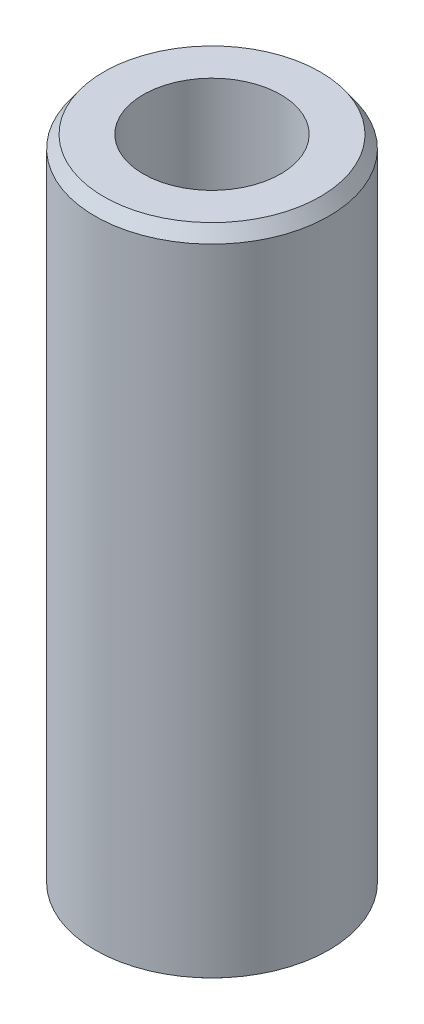
ISO-10303-21;
HEADER;
FILE_DESCRIPTION(('STEP AP214'),'2;1');
FILE_NAME('part.step','',(''),(''),'','','');
FILE_SCHEMA(('AUTOMOTIVE_DESIGN { 1 0 10303 214 1 1 1 1 }'));
ENDSEC;
DATA;
#1=APPLICATION_CONTEXT('core data for automotive mechanical design processes');
#2=APPLICATION_PROTOCOL_DEFINITION('international standard','automotive_design',2000,#1);
#3=PRODUCT_CONTEXT('',#1,'mechanical');
#4=PRODUCT('Part','Part','',(#3));
#5=PRODUCT_RELATED_PRODUCT_CATEGORY('part','',(#4));
#6=PRODUCT_DEFINITION_FORMATION('','',#4);
#7=PRODUCT_DEFINITION_CONTEXT('part definition',#1,'design');
#8=PRODUCT_DEFINITION('design','',#6,#7);
#9=PRODUCT_DEFINITION_SHAPE('','',#8);
#10=(LENGTH_UNIT() NAMED_UNIT(*) SI_UNIT(.MILLI.,.METRE.));
#11=(NAMED_UNIT(*) PLANE_ANGLE_UNIT() SI_UNIT($,.RADIAN.));
#12=(NAMED_UNIT(*) SI_UNIT($,.STERADIAN.) SOLID_ANGLE_UNIT());
#13=UNCERTAINTY_MEASURE_WITH_UNIT(LENGTH_MEASURE(1.E-05),#10,'distance_accuracy_value','');
#14=(GEOMETRIC_REPRESENTATION_CONTEXT(3) GLOBAL_UNCERTAINTY_ASSIGNED_CONTEXT((#13)) GLOBAL_UNIT_ASSIGNED_CONTEXT((#10,
#11,#12)) REPRESENTATION_CONTEXT('',''));
#15=CARTESIAN_POINT('',(0.,0.,0.));
#16=DIRECTION('',(0.,0.,1.));
#17=DIRECTION('',(1.,0.,0.));
#18=AXIS2_PLACEMENT_3D('',#15,#16,#17);
#19=CARTESIAN_POINT('',(0.,98.253043161147,0.));
#20=DIRECTION('',(0.,-1.,0.));
#21=DIRECTION('',(0.,0.,-1.));
#22=AXIS2_PLACEMENT_3D('',#19,#20,#21);
#23=CYLINDRICAL_SURFACE('',#22,17.5);
#24=CARTESIAN_POINT('',(0.,96.3891057133888,0.));
#25=DIRECTION('',(0.,1.,0.));
#26=DIRECTION('',(0.,0.,1.));
#27=AXIS2_PLACEMENT_3D('',#24,#25,#26);
#28=CIRCLE('',#27,17.5);
#29=CARTESIAN_POINT('',(0.,96.3891057133888,-17.5));
#30=VERTEX_POINT('',#29);
#31=EDGE_CURVE('E50',#30,#30,#28,.F.);
#32=ORIENTED_EDGE('',*,*,#31,.T.);
#33=EDGE_LOOP('',(#32));
#34=FACE_BOUND('',#33,.T.);
#35=CARTESIAN_POINT('',(0.,1.31401541733753,0.));
#36=DIRECTION('',(0.,1.,0.));
#37=DIRECTION('',(0.,0.,1.));
#38=AXIS2_PLACEMENT_3D('',#35,#36,#37);
#39=CIRCLE('',#38,17.5);
#40=CARTESIAN_POINT('',(0.,1.31401541733753,17.5));
#41=VERTEX_POINT('',#40);
#42=EDGE_CURVE('E51',#41,#41,#39,.T.);
#43=ORIENTED_EDGE('',*,*,#42,.T.);
#44=EDGE_LOOP('',(#43));
#45=FACE_BOUND('',#44,.T.);
#46=ADVANCED_FACE('F39',(#34,#45),#23,.T.);
#47=CARTESIAN_POINT('',(0.,98.253043161147,0.));
#48=DIRECTION('',(0.,1.,0.));
#49=DIRECTION('',(0.,0.,1.));
#50=AXIS2_PLACEMENT_3D('',#47,#48,#49);
#51=PLANE('',#50);
#52=CARTESIAN_POINT('',(0.,98.253043161147,0.));
#53=DIRECTION('',(0.,1.,0.));
#54=DIRECTION('',(0.,0.,1.));
#55=AXIS2_PLACEMENT_3D('',#52,#53,#54);
#56=CIRCLE('',#55,16.1859845826625);
#57=CARTESIAN_POINT('',(0.,98.253043161147,-16.1859845826625));
#58=VERTEX_POINT('',#57);
#59=EDGE_CURVE('E54',#58,#58,#56,.T.);
#60=ORIENTED_EDGE('',*,*,#59,.T.);
#61=EDGE_LOOP('',(#60));
#62=FACE_BOUND('',#61,.T.);
#63=CARTESIAN_POINT('',(0.,98.253043161147,0.));
#64=DIRECTION('',(0.,1.,0.));
#65=DIRECTION('',(0.,0.,1.));
#66=AXIS2_PLACEMENT_3D('',#63,#64,#65);
#67=CIRCLE('',#66,10.2834657674829);
#68=CARTESIAN_POINT('',(0.,98.253043161147,10.2834657674829));
#69=VERTEX_POINT('',#68);
#70=EDGE_CURVE('E58',#69,#69,#67,.T.);
#71=ORIENTED_EDGE('',*,*,#70,.F.);
#72=EDGE_LOOP('',(#71));
#73=FACE_BOUND('',#72,.T.);
#74=ADVANCED_FACE('F69',(#62,#73),#51,.T.);
#75=CARTESIAN_POINT('',(0.,0.,0.));
#76=DIRECTION('',(0.,1.,0.));
#77=DIRECTION('',(0.,0.,1.));
#78=AXIS2_PLACEMENT_3D('',#75,#76,#77);
#79=PLANE('',#78);
#80=CARTESIAN_POINT('',(0.,0.,0.));
#81=DIRECTION('',(0.,1.,0.));
#82=DIRECTION('',(0.,0.,1.));
#83=AXIS2_PLACEMENT_3D('',#80,#81,#82);
#84=CIRCLE('',#83,15.6360625522419);
#85=CARTESIAN_POINT('',(0.,0.,15.6360625522419));
#86=VERTEX_POINT('',#85);
#87=EDGE_CURVE('E10',#86,#86,#84,.F.);
#88=ORIENTED_EDGE('',*,*,#87,.T.);
#89=EDGE_LOOP('',(#88));
#90=FACE_BOUND('',#89,.T.);
#91=CARTESIAN_POINT('',(0.,0.,0.));
#92=DIRECTION('',(0.,1.,0.));
#93=DIRECTION('',(0.,0.,1.));
#94=AXIS2_PLACEMENT_3D('',#91,#92,#93);
#95=CIRCLE('',#94,10.2834657674829);
#96=CARTESIAN_POINT('',(0.,0.,10.2834657674829));
#97=VERTEX_POINT('',#96);
#98=EDGE_CURVE('E63',#97,#97,#95,.T.);
#99=ORIENTED_EDGE('',*,*,#98,.T.);
#100=EDGE_LOOP('',(#99));
#101=FACE_BOUND('',#100,.T.);
#102=ADVANCED_FACE('F75',(#90,#101),#79,.F.);
#103=CARTESIAN_POINT('',(0.,98.253043161147,0.));
#104=DIRECTION('',(0.,-1.,0.));
#105=DIRECTION('',(0.,0.,-1.));
#106=AXIS2_PLACEMENT_3D('',#103,#104,#105);
#107=CYLINDRICAL_SURFACE('',#106,10.2834657674829);
#108=ORIENTED_EDGE('',*,*,#70,.T.);
#109=EDGE_LOOP('',(#108));
#110=FACE_BOUND('',#109,.T.);
#111=ORIENTED_EDGE('',*,*,#98,.F.);
#112=EDGE_LOOP('',(#111));
#113=FACE_BOUND('',#112,.T.);
#114=ADVANCED_FACE('F70',(#110,#113),#107,.F.);
#115=CARTESIAN_POINT('',(0.,98.253043161147,0.));
#116=DIRECTION('',(0.,-1.,0.));
#117=DIRECTION('',(0.,0.,-1.));
#118=AXIS2_PLACEMENT_3D('',#115,#116,#117);
#119=CONICAL_SURFACE('',#118,16.1859845826625,0.614052116383976);
#120=CARTESIAN_POINT('',(0.,96.3891057133888,-17.5));
#121=CARTESIAN_POINT('',(0.,96.4085217284696,-17.4863123394027));
#122=CARTESIAN_POINT('',(0.,96.4279377435504,-17.4726246788055));
#123=CARTESIAN_POINT('',(0.,96.4667697737121,-17.4452493576109));
#124=CARTESIAN_POINT('',(0.,96.4861857887929,-17.4315616970137));
#125=CARTESIAN_POINT('',(0.,96.5250178189545,-17.4041863758191));
#126=CARTESIAN_POINT('',(0.,96.5444338340353,-17.3904987152219));
#127=CARTESIAN_POINT('',(0.,96.583265864197,-17.3631233940274));
#128=CARTESIAN_POINT('',(0.,96.6026818792778,-17.3494357334301));
#129=CARTESIAN_POINT('',(0.,96.6415139094394,-17.3220604122356));
#130=CARTESIAN_POINT('',(0.,96.6609299245202,-17.3083727516383));
#131=CARTESIAN_POINT('',(0.,96.6997619546818,-17.2809974304438));
#132=CARTESIAN_POINT('',(0.,96.7191779697627,-17.2673097698465));
#133=CARTESIAN_POINT('',(0.,96.7580099999243,-17.239934448652));
#134=CARTESIAN_POINT('',(0.,96.7774260150051,-17.2262467880547));
#135=CARTESIAN_POINT('',(0.,96.8162580451667,-17.1988714668602));
#136=CARTESIAN_POINT('',(0.,96.8356740602475,-17.1851838062629));
#137=CARTESIAN_POINT('',(0.,96.8745060904092,-17.1578084850684));
#138=CARTESIAN_POINT('',(0.,96.89392210549,-17.1441208244711));
#139=CARTESIAN_POINT('',(0.,96.9327541356516,-17.1167455032766));
#140=CARTESIAN_POINT('',(0.,96.9521701507324,-17.1030578426793));
#141=CARTESIAN_POINT('',(0.,96.9910021808941,-17.0756825214848));
#142=CARTESIAN_POINT('',(0.,97.0104181959749,-17.0619948608875));
#143=CARTESIAN_POINT('',(0.,97.0492502261365,-17.034619539693));
#144=CARTESIAN_POINT('',(0.,97.0686662412173,-17.0209318790957));
#145=CARTESIAN_POINT('',(0.,97.1074982713789,-16.9935565579012));
#146=CARTESIAN_POINT('',(0.,97.1269142864598,-16.9798688973039));
#147=CARTESIAN_POINT('',(0.,97.1657463166214,-16.9524935761094));
#148=CARTESIAN_POINT('',(0.,97.1851623317022,-16.9388059155121));
#149=CARTESIAN_POINT('',(0.,97.2239943618638,-16.9114305943176));
#150=CARTESIAN_POINT('',(0.,97.2434103769446,-16.8977429337203));
#151=CARTESIAN_POINT('',(0.,97.2822424071063,-16.8703676125258));
#152=CARTESIAN_POINT('',(0.,97.3016584221871,-16.8566799519285));
#153=CARTESIAN_POINT('',(0.,97.3404904523487,-16.829304630734));
#154=CARTESIAN_POINT('',(0.,97.3599064674295,-16.8156169701367));
#155=CARTESIAN_POINT('',(0.,97.3987384975912,-16.7882416489422));
#156=CARTESIAN_POINT('',(0.,97.418154512672,-16.7745539883449));
#157=CARTESIAN_POINT('',(0.,97.4569865428336,-16.7471786671504));
#158=CARTESIAN_POINT('',(0.,97.4764025579144,-16.7334910065531));
#159=CARTESIAN_POINT('',(0.,97.5152345880761,-16.7061156853586));
#160=CARTESIAN_POINT('',(0.,97.5346506031569,-16.6924280247613));
#161=CARTESIAN_POINT('',(0.,97.5734826333185,-16.6650527035668));
#162=CARTESIAN_POINT('',(0.,97.5928986483993,-16.6513650429695));
#163=CARTESIAN_POINT('',(0.,97.6317306785609,-16.623989721775));
#164=CARTESIAN_POINT('',(0.,97.6511466936417,-16.6103020611777));
#165=CARTESIAN_POINT('',(0.,97.6899787238034,-16.5829267399832));
#166=CARTESIAN_POINT('',(0.,97.7093947388842,-16.5692390793859));
#167=CARTESIAN_POINT('',(0.,97.7482267690458,-16.5418637581914));
#168=CARTESIAN_POINT('',(0.,97.7676427841266,-16.5281760975941));
#169=CARTESIAN_POINT('',(0.,97.8064748142883,-16.5008007763996));
#170=CARTESIAN_POINT('',(0.,97.8258908293691,-16.4871131158023));
#171=CARTESIAN_POINT('',(0.,97.8647228595307,-16.4597377946078));
#172=CARTESIAN_POINT('',(0.,97.8841388746115,-16.4460501340105));
#173=CARTESIAN_POINT('',(0.,97.9229709047731,-16.418674812816));
#174=CARTESIAN_POINT('',(0.,97.942386919854,-16.4049871522187));
#175=CARTESIAN_POINT('',(0.,97.9812189500156,-16.3776118310242));
#176=CARTESIAN_POINT('',(0.,98.0006349650964,-16.3639241704269));
#177=CARTESIAN_POINT('',(0.,98.039466995258,-16.3365488492324));
#178=CARTESIAN_POINT('',(0.,98.0588830103388,-16.3228611886351));
#179=CARTESIAN_POINT('',(0.,98.0977150405005,-16.2954858674406));
#180=CARTESIAN_POINT('',(0.,98.1171310555813,-16.2817982068433));
#181=CARTESIAN_POINT('',(0.,98.1559630857429,-16.2544228856488));
#182=CARTESIAN_POINT('',(0.,98.1753791008237,-16.2407352250515));
#183=CARTESIAN_POINT('',(0.,98.2142111309854,-16.213359903857));
#184=CARTESIAN_POINT('',(0.,98.2336271460662,-16.1996722432597));
#185=CARTESIAN_POINT('',(0.,98.253043161147,-16.1859845826625));
#186=B_SPLINE_CURVE_WITH_KNOTS('',3,(#120,#121,#122,#123,#124,#125,#126,#127,#128,#129,#130,
#131,#132,#133,#134,#135,#136,#137,#138,#139,#140,#141,#142,#143,#144,#145,#146,#147,#148,#149,
#150,#151,#152,#153,#154,#155,#156,#157,#158,#159,#160,#161,#162,#163,#164,#165,#166,#167,#168,
#169,#170,#171,#172,#173,#174,#175,#176,#177,#178,#179,#180,#181,#182,#183,#184,#185),
.UNSPECIFIED.,.F.,.F.,(4,2,2,2,2,2,2,2,2,2,2,2,2,2,2,2,2,2,2,2,2,2,2,2,2,2,2,2,2,2,2,2,4),(0.,
0.0712671259992962,0.142534251998592,0.213801377997889,0.285068503997185,0.356335629996481,
0.427602755995766,0.498869881995062,0.570137007994359,0.641404133993655,0.712671259992951,
0.783938385992234,0.85520551199153,0.926472637990827,0.997739763990123,1.06900688998942,
1.1402740159887,1.211541141988,1.2828082679873,1.35407539398659,1.42534251998589,
1.49660964598518,1.56787677198447,1.63914389798376,1.71041102398306,1.78167814998236,
1.85294527598165,1.92421240198094,1.99547952798023,2.06674665397953,2.13801377997883,
2.20928090597812,2.28054803197742),.UNSPECIFIED.);
#187=EDGE_CURVE('BSEAM81',#30,#58,#186,.T.);
#188=ORIENTED_EDGE('',*,*,#31,.F.);
#189=ORIENTED_EDGE('',*,*,#59,.F.);
#190=ORIENTED_EDGE('',*,*,#187,.T.);
#191=ORIENTED_EDGE('',*,*,#187,.F.);
#192=EDGE_LOOP('',(#188,#190,#189,#191));
#193=FACE_BOUND('',#192,.T.);
#194=ADVANCED_FACE('F81',(#193),#119,.T.);
#195=CARTESIAN_POINT('',(0.,1.31401541733753,0.));
#196=DIRECTION('',(0.,1.,0.));
#197=DIRECTION('',(0.,0.,1.));
#198=AXIS2_PLACEMENT_3D('',#195,#196,#197);
#199=CONICAL_SURFACE('',#198,17.5,0.956744210410921);
#200=ORIENTED_EDGE('',*,*,#87,.F.);
#201=EDGE_LOOP('',(#200));
#202=FACE_BOUND('',#201,.T.);
#203=ORIENTED_EDGE('',*,*,#42,.F.);
#204=EDGE_LOOP('',(#203));
#205=FACE_BOUND('',#204,.T.);
#206=ADVANCED_FACE('F45',(#202,#205),#199,.T.);
#207=CLOSED_SHELL('',(#46,#74,#102,#114,#194,#206));
#208=MANIFOLD_SOLID_BREP('B2',#207);
#209=ADVANCED_BREP_SHAPE_REPRESENTATION('',(#18,#208),#14);
#210=SHAPE_DEFINITION_REPRESENTATION(#9,#209);
ENDSEC;
END-ISO-10303-21;
